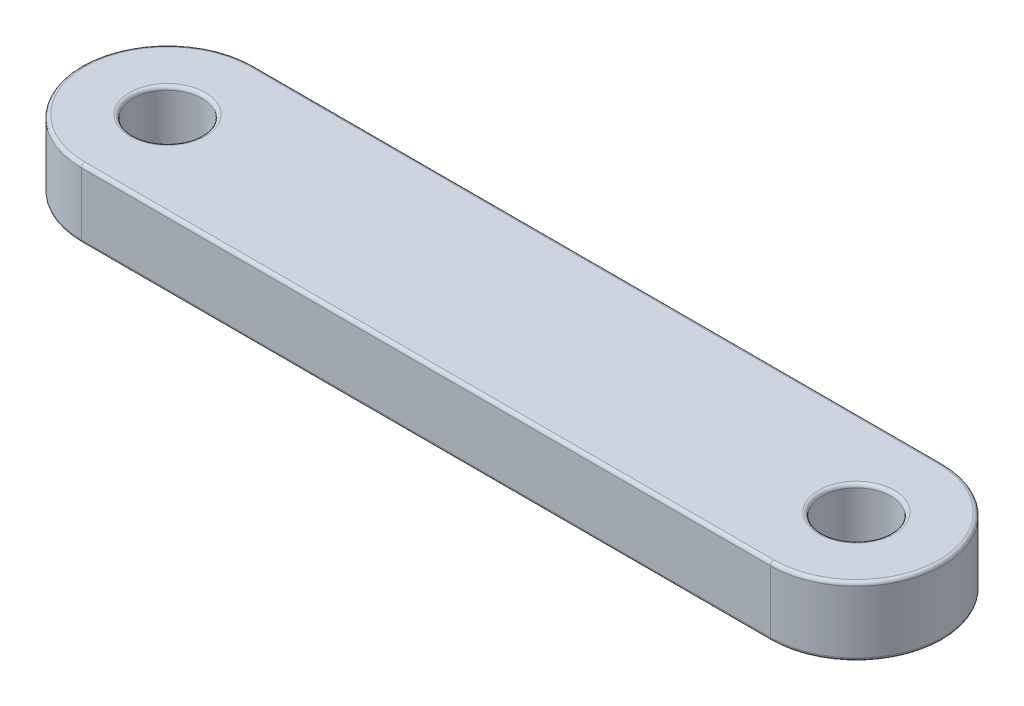
ISO-10303-21;
HEADER;
FILE_DESCRIPTION(('STEP AP214'),'2;1');
FILE_NAME('part.step','',(''),(''),'','','');
FILE_SCHEMA(('AUTOMOTIVE_DESIGN { 1 0 10303 214 1 1 1 1 }'));
ENDSEC;
DATA;
#1=APPLICATION_CONTEXT('core data for automotive mechanical design processes');
#2=APPLICATION_PROTOCOL_DEFINITION('international standard','automotive_design',2000,#1);
#3=PRODUCT_CONTEXT('',#1,'mechanical');
#4=PRODUCT('Part','Part','',(#3));
#5=PRODUCT_RELATED_PRODUCT_CATEGORY('part','',(#4));
#6=PRODUCT_DEFINITION_FORMATION('','',#4);
#7=PRODUCT_DEFINITION_CONTEXT('part definition',#1,'design');
#8=PRODUCT_DEFINITION('design','',#6,#7);
#9=PRODUCT_DEFINITION_SHAPE('','',#8);
#10=(LENGTH_UNIT() NAMED_UNIT(*) SI_UNIT(.MILLI.,.METRE.));
#11=(NAMED_UNIT(*) PLANE_ANGLE_UNIT() SI_UNIT($,.RADIAN.));
#12=(NAMED_UNIT(*) SI_UNIT($,.STERADIAN.) SOLID_ANGLE_UNIT());
#13=UNCERTAINTY_MEASURE_WITH_UNIT(LENGTH_MEASURE(1.E-05),#10,'distance_accuracy_value','');
#14=(GEOMETRIC_REPRESENTATION_CONTEXT(3) GLOBAL_UNCERTAINTY_ASSIGNED_CONTEXT((#13)) GLOBAL_UNIT_ASSIGNED_CONTEXT((#10,
#11,#12)) REPRESENTATION_CONTEXT('',''));
#15=CARTESIAN_POINT('',(0.,0.,0.));
#16=DIRECTION('',(0.,0.,1.));
#17=DIRECTION('',(1.,0.,0.));
#18=AXIS2_PLACEMENT_3D('',#15,#16,#17);
#19=CARTESIAN_POINT('',(-100.,20.,0.));
#20=DIRECTION('',(0.,1.,0.));
#21=DIRECTION('',(0.,0.,1.));
#22=AXIS2_PLACEMENT_3D('',#19,#20,#21);
#23=PLANE('',#22);
#24=CARTESIAN_POINT('',(100.,20.,0.));
#25=DIRECTION('',(0.,1.,0.));
#26=DIRECTION('',(0.,0.,1.));
#27=AXIS2_PLACEMENT_3D('',#24,#25,#26);
#28=CIRCLE('',#27,11.);
#29=CARTESIAN_POINT('',(100.,20.,11.));
#30=VERTEX_POINT('',#29);
#31=EDGE_CURVE('E11',#30,#30,#28,.F.);
#32=ORIENTED_EDGE('',*,*,#31,.T.);
#33=EDGE_LOOP('',(#32));
#34=FACE_BOUND('',#33,.T.);
#35=CARTESIAN_POINT('',(100.,20.,0.));
#36=DIRECTION('',(0.,1.,0.));
#37=DIRECTION('',(0.,0.,1.));
#38=AXIS2_PLACEMENT_3D('',#35,#36,#37);
#39=CIRCLE('',#38,24.);
#40=CARTESIAN_POINT('',(100.,20.,24.));
#41=VERTEX_POINT('',#40);
#42=CARTESIAN_POINT('',(100.,20.,-24.));
#43=VERTEX_POINT('',#42);
#44=EDGE_CURVE('E50',#41,#43,#39,.T.);
#45=ORIENTED_EDGE('',*,*,#44,.T.);
#46=DIRECTION('',(-1.,0.,0.));
#47=VECTOR('',#46,1.);
#48=CARTESIAN_POINT('',(-100.,20.,-24.));
#49=LINE('',#48,#47);
#50=CARTESIAN_POINT('',(-100.,20.,-24.));
#51=VERTEX_POINT('',#50);
#52=EDGE_CURVE('E42',#43,#51,#49,.T.);
#53=ORIENTED_EDGE('',*,*,#52,.T.);
#54=CARTESIAN_POINT('',(-100.,20.,0.));
#55=DIRECTION('',(0.,1.,0.));
#56=DIRECTION('',(0.,0.,1.));
#57=AXIS2_PLACEMENT_3D('',#54,#55,#56);
#58=CIRCLE('',#57,24.);
#59=CARTESIAN_POINT('',(-100.,20.,24.));
#60=VERTEX_POINT('',#59);
#61=EDGE_CURVE('E168',#51,#60,#58,.T.);
#62=ORIENTED_EDGE('',*,*,#61,.T.);
#63=DIRECTION('',(1.,0.,0.));
#64=VECTOR('',#63,1.);
#65=CARTESIAN_POINT('',(100.,20.,24.));
#66=LINE('',#65,#64);
#67=EDGE_CURVE('E55',#60,#41,#66,.T.);
#68=ORIENTED_EDGE('',*,*,#67,.T.);
#69=EDGE_LOOP('',(#45,#53,#62,#68));
#70=FACE_BOUND('',#69,.T.);
#71=CARTESIAN_POINT('',(-100.,20.,0.));
#72=DIRECTION('',(0.,1.,0.));
#73=DIRECTION('',(0.,0.,1.));
#74=AXIS2_PLACEMENT_3D('',#71,#72,#73);
#75=CIRCLE('',#74,11.);
#76=CARTESIAN_POINT('',(-100.,20.,11.));
#77=VERTEX_POINT('',#76);
#78=EDGE_CURVE('E165',#77,#77,#75,.F.);
#79=ORIENTED_EDGE('',*,*,#78,.T.);
#80=EDGE_LOOP('',(#79));
#81=FACE_BOUND('',#80,.T.);
#82=ADVANCED_FACE('F33',(#34,#70,#81),#23,.T.);
#83=CARTESIAN_POINT('',(-100.,0.,0.));
#84=DIRECTION('',(0.,1.,0.));
#85=DIRECTION('',(0.,0.,1.));
#86=AXIS2_PLACEMENT_3D('',#83,#84,#85);
#87=PLANE('',#86);
#88=CARTESIAN_POINT('',(100.,0.,0.));
#89=DIRECTION('',(0.,1.,0.));
#90=DIRECTION('',(0.,0.,1.));
#91=AXIS2_PLACEMENT_3D('',#88,#89,#90);
#92=CIRCLE('',#91,11.);
#93=CARTESIAN_POINT('',(100.,0.,11.));
#94=VERTEX_POINT('',#93);
#95=EDGE_CURVE('E130',#94,#94,#92,.T.);
#96=ORIENTED_EDGE('',*,*,#95,.T.);
#97=EDGE_LOOP('',(#96));
#98=FACE_BOUND('',#97,.T.);
#99=CARTESIAN_POINT('',(-100.,0.,0.));
#100=DIRECTION('',(0.,1.,0.));
#101=DIRECTION('',(0.,0.,1.));
#102=AXIS2_PLACEMENT_3D('',#99,#100,#101);
#103=CIRCLE('',#102,11.);
#104=CARTESIAN_POINT('',(-100.,0.,11.));
#105=VERTEX_POINT('',#104);
#106=EDGE_CURVE('E127',#105,#105,#103,.T.);
#107=ORIENTED_EDGE('',*,*,#106,.T.);
#108=EDGE_LOOP('',(#107));
#109=FACE_BOUND('',#108,.T.);
#110=CARTESIAN_POINT('',(100.,0.,0.));
#111=DIRECTION('',(0.,1.,0.));
#112=DIRECTION('',(0.,0.,1.));
#113=AXIS2_PLACEMENT_3D('',#110,#111,#112);
#114=CIRCLE('',#113,24.);
#115=CARTESIAN_POINT('',(100.,0.,-24.));
#116=VERTEX_POINT('',#115);
#117=CARTESIAN_POINT('',(100.,0.,24.));
#118=VERTEX_POINT('',#117);
#119=EDGE_CURVE('E126',#116,#118,#114,.F.);
#120=ORIENTED_EDGE('',*,*,#119,.T.);
#121=DIRECTION('',(1.,0.,0.));
#122=VECTOR('',#121,1.);
#123=CARTESIAN_POINT('',(-100.,0.,24.));
#124=LINE('',#123,#122);
#125=CARTESIAN_POINT('',(-100.,0.,24.));
#126=VERTEX_POINT('',#125);
#127=EDGE_CURVE('E105',#118,#126,#124,.F.);
#128=ORIENTED_EDGE('',*,*,#127,.T.);
#129=CARTESIAN_POINT('',(-100.,0.,0.));
#130=DIRECTION('',(0.,1.,0.));
#131=DIRECTION('',(0.,0.,1.));
#132=AXIS2_PLACEMENT_3D('',#129,#130,#131);
#133=CIRCLE('',#132,24.);
#134=CARTESIAN_POINT('',(-100.,0.,-24.));
#135=VERTEX_POINT('',#134);
#136=EDGE_CURVE('E115',#126,#135,#133,.F.);
#137=ORIENTED_EDGE('',*,*,#136,.T.);
#138=DIRECTION('',(-1.,0.,0.));
#139=VECTOR('',#138,1.);
#140=CARTESIAN_POINT('',(-100.,0.,-24.));
#141=LINE('',#140,#139);
#142=EDGE_CURVE('E121',#135,#116,#141,.F.);
#143=ORIENTED_EDGE('',*,*,#142,.T.);
#144=EDGE_LOOP('',(#120,#128,#137,#143));
#145=FACE_BOUND('',#144,.T.);
#146=ADVANCED_FACE('F124',(#98,#109,#145),#87,.F.);
#147=CARTESIAN_POINT('',(-100.,20.,0.));
#148=DIRECTION('',(0.,-1.,0.));
#149=DIRECTION('',(0.,0.,-1.));
#150=AXIS2_PLACEMENT_3D('',#147,#148,#149);
#151=CYLINDRICAL_SURFACE('',#150,25.);
#152=DIRECTION('',(0.,-1.,0.));
#153=VECTOR('',#152,1.);
#154=CARTESIAN_POINT('',(-100.,20.,-25.));
#155=LINE('',#154,#153);
#156=CARTESIAN_POINT('',(-100.,19.,-25.));
#157=VERTEX_POINT('',#156);
#158=CARTESIAN_POINT('',(-100.,1.,-25.));
#159=VERTEX_POINT('',#158);
#160=EDGE_CURVE('E177',#157,#159,#155,.T.);
#161=ORIENTED_EDGE('',*,*,#160,.T.);
#162=CARTESIAN_POINT('',(-100.,1.,0.));
#163=DIRECTION('',(0.,1.,0.));
#164=DIRECTION('',(0.,0.,1.));
#165=AXIS2_PLACEMENT_3D('',#162,#163,#164);
#166=CIRCLE('',#165,25.);
#167=CARTESIAN_POINT('',(-100.,1.,25.));
#168=VERTEX_POINT('',#167);
#169=EDGE_CURVE('E163',#159,#168,#166,.T.);
#170=ORIENTED_EDGE('',*,*,#169,.T.);
#171=DIRECTION('',(0.,-1.,0.));
#172=VECTOR('',#171,1.);
#173=CARTESIAN_POINT('',(-100.,20.,25.));
#174=LINE('',#173,#172);
#175=CARTESIAN_POINT('',(-100.,19.,25.));
#176=VERTEX_POINT('',#175);
#177=EDGE_CURVE('E122',#176,#168,#174,.T.);
#178=ORIENTED_EDGE('',*,*,#177,.F.);
#179=CARTESIAN_POINT('',(-100.,19.,0.));
#180=DIRECTION('',(0.,1.,0.));
#181=DIRECTION('',(0.,0.,1.));
#182=AXIS2_PLACEMENT_3D('',#179,#180,#181);
#183=CIRCLE('',#182,25.);
#184=EDGE_CURVE('E161',#176,#157,#183,.F.);
#185=ORIENTED_EDGE('',*,*,#184,.T.);
#186=EDGE_LOOP('',(#161,#170,#178,#185));
#187=FACE_BOUND('',#186,.T.);
#188=ADVANCED_FACE('F203',(#187),#151,.T.);
#189=CARTESIAN_POINT('',(-100.,20.,25.));
#190=DIRECTION('',(0.,0.,-1.));
#191=DIRECTION('',(-1.,0.,0.));
#192=AXIS2_PLACEMENT_3D('',#189,#190,#191);
#193=PLANE('',#192);
#194=ORIENTED_EDGE('',*,*,#177,.T.);
#195=DIRECTION('',(1.,0.,0.));
#196=VECTOR('',#195,1.);
#197=CARTESIAN_POINT('',(-100.,1.,25.));
#198=LINE('',#197,#196);
#199=CARTESIAN_POINT('',(100.,1.,25.));
#200=VERTEX_POINT('',#199);
#201=EDGE_CURVE('E108',#168,#200,#198,.T.);
#202=ORIENTED_EDGE('',*,*,#201,.T.);
#203=DIRECTION('',(0.,-1.,0.));
#204=VECTOR('',#203,1.);
#205=CARTESIAN_POINT('',(100.,20.,25.));
#206=LINE('',#205,#204);
#207=CARTESIAN_POINT('',(100.,19.,25.));
#208=VERTEX_POINT('',#207);
#209=EDGE_CURVE('E200',#208,#200,#206,.T.);
#210=ORIENTED_EDGE('',*,*,#209,.F.);
#211=DIRECTION('',(1.,0.,0.));
#212=VECTOR('',#211,1.);
#213=CARTESIAN_POINT('',(-100.,19.,25.));
#214=LINE('',#213,#212);
#215=EDGE_CURVE('E149',#208,#176,#214,.F.);
#216=ORIENTED_EDGE('',*,*,#215,.T.);
#217=EDGE_LOOP('',(#194,#202,#210,#216));
#218=FACE_BOUND('',#217,.T.);
#219=ADVANCED_FACE('F198',(#218),#193,.F.);
#220=CARTESIAN_POINT('',(100.,20.,0.));
#221=DIRECTION('',(0.,-1.,0.));
#222=DIRECTION('',(0.,0.,-1.));
#223=AXIS2_PLACEMENT_3D('',#220,#221,#222);
#224=CYLINDRICAL_SURFACE('',#223,25.);
#225=ORIENTED_EDGE('',*,*,#209,.T.);
#226=CARTESIAN_POINT('',(100.,1.,0.));
#227=DIRECTION('',(0.,1.,0.));
#228=DIRECTION('',(0.,0.,1.));
#229=AXIS2_PLACEMENT_3D('',#226,#227,#228);
#230=CIRCLE('',#229,25.);
#231=CARTESIAN_POINT('',(100.,1.,-25.));
#232=VERTEX_POINT('',#231);
#233=EDGE_CURVE('E154',#200,#232,#230,.T.);
#234=ORIENTED_EDGE('',*,*,#233,.T.);
#235=DIRECTION('',(0.,-1.,0.));
#236=VECTOR('',#235,1.);
#237=CARTESIAN_POINT('',(100.,20.,-25.));
#238=LINE('',#237,#236);
#239=CARTESIAN_POINT('',(100.,19.,-25.));
#240=VERTEX_POINT('',#239);
#241=EDGE_CURVE('E206',#240,#232,#238,.T.);
#242=ORIENTED_EDGE('',*,*,#241,.F.);
#243=CARTESIAN_POINT('',(100.,19.,0.));
#244=DIRECTION('',(0.,1.,0.));
#245=DIRECTION('',(0.,0.,1.));
#246=AXIS2_PLACEMENT_3D('',#243,#244,#245);
#247=CIRCLE('',#246,25.);
#248=EDGE_CURVE('E152',#240,#208,#247,.F.);
#249=ORIENTED_EDGE('',*,*,#248,.T.);
#250=EDGE_LOOP('',(#225,#234,#242,#249));
#251=FACE_BOUND('',#250,.T.);
#252=ADVANCED_FACE('F219',(#251),#224,.T.);
#253=CARTESIAN_POINT('',(-100.,20.,-25.));
#254=DIRECTION('',(0.,0.,1.));
#255=DIRECTION('',(1.,0.,0.));
#256=AXIS2_PLACEMENT_3D('',#253,#254,#255);
#257=PLANE('',#256);
#258=ORIENTED_EDGE('',*,*,#241,.T.);
#259=DIRECTION('',(-1.,0.,0.));
#260=VECTOR('',#259,1.);
#261=CARTESIAN_POINT('',(-100.,1.,-25.));
#262=LINE('',#261,#260);
#263=EDGE_CURVE('E159',#232,#159,#262,.T.);
#264=ORIENTED_EDGE('',*,*,#263,.T.);
#265=ORIENTED_EDGE('',*,*,#160,.F.);
#266=DIRECTION('',(-1.,0.,0.));
#267=VECTOR('',#266,1.);
#268=CARTESIAN_POINT('',(100.,19.,-25.));
#269=LINE('',#268,#267);
#270=EDGE_CURVE('E156',#157,#240,#269,.F.);
#271=ORIENTED_EDGE('',*,*,#270,.T.);
#272=EDGE_LOOP('',(#258,#264,#265,#271));
#273=FACE_BOUND('',#272,.T.);
#274=ADVANCED_FACE('F223',(#273),#257,.F.);
#275=CARTESIAN_POINT('',(-100.,20.,0.));
#276=DIRECTION('',(0.,-1.,0.));
#277=DIRECTION('',(0.,0.,-1.));
#278=AXIS2_PLACEMENT_3D('',#275,#276,#277);
#279=CYLINDRICAL_SURFACE('',#278,9.99999999999999);
#280=CARTESIAN_POINT('',(-100.,1.,0.));
#281=DIRECTION('',(0.,1.,0.));
#282=DIRECTION('',(0.,0.,1.));
#283=AXIS2_PLACEMENT_3D('',#280,#281,#282);
#284=CIRCLE('',#283,9.99999999999999);
#285=CARTESIAN_POINT('',(-100.,1.,9.99999999999999));
#286=VERTEX_POINT('',#285);
#287=EDGE_CURVE('E146',#286,#286,#284,.F.);
#288=ORIENTED_EDGE('',*,*,#287,.T.);
#289=EDGE_LOOP('',(#288));
#290=FACE_BOUND('',#289,.T.);
#291=CARTESIAN_POINT('',(-100.,19.,0.));
#292=DIRECTION('',(0.,1.,0.));
#293=DIRECTION('',(0.,0.,1.));
#294=AXIS2_PLACEMENT_3D('',#291,#292,#293);
#295=CIRCLE('',#294,9.99999999999999);
#296=CARTESIAN_POINT('',(-100.,19.,9.99999999999999));
#297=VERTEX_POINT('',#296);
#298=EDGE_CURVE('E143',#297,#297,#295,.T.);
#299=ORIENTED_EDGE('',*,*,#298,.T.);
#300=EDGE_LOOP('',(#299));
#301=FACE_BOUND('',#300,.T.);
#302=ADVANCED_FACE('F239',(#290,#301),#279,.F.);
#303=CARTESIAN_POINT('',(100.,20.,0.));
#304=DIRECTION('',(0.,-1.,0.));
#305=DIRECTION('',(0.,0.,-1.));
#306=AXIS2_PLACEMENT_3D('',#303,#304,#305);
#307=CYLINDRICAL_SURFACE('',#306,9.99999999999999);
#308=CARTESIAN_POINT('',(100.,1.,0.));
#309=DIRECTION('',(0.,1.,0.));
#310=DIRECTION('',(0.,0.,1.));
#311=AXIS2_PLACEMENT_3D('',#308,#309,#310);
#312=CIRCLE('',#311,9.99999999999999);
#313=CARTESIAN_POINT('',(100.,1.,9.99999999999999));
#314=VERTEX_POINT('',#313);
#315=EDGE_CURVE('E140',#314,#314,#312,.F.);
#316=ORIENTED_EDGE('',*,*,#315,.T.);
#317=EDGE_LOOP('',(#316));
#318=FACE_BOUND('',#317,.T.);
#319=CARTESIAN_POINT('',(100.,19.,0.));
#320=DIRECTION('',(0.,1.,0.));
#321=DIRECTION('',(0.,0.,1.));
#322=AXIS2_PLACEMENT_3D('',#319,#320,#321);
#323=CIRCLE('',#322,9.99999999999999);
#324=CARTESIAN_POINT('',(100.,19.,9.99999999999999));
#325=VERTEX_POINT('',#324);
#326=EDGE_CURVE('E137',#325,#325,#323,.T.);
#327=ORIENTED_EDGE('',*,*,#326,.T.);
#328=EDGE_LOOP('',(#327));
#329=FACE_BOUND('',#328,.T.);
#330=ADVANCED_FACE('F241',(#318,#329),#307,.F.);
#331=CARTESIAN_POINT('',(100.,1.,0.));
#332=DIRECTION('',(0.,1.,0.));
#333=DIRECTION('',(0.,0.,1.));
#334=AXIS2_PLACEMENT_3D('',#331,#332,#333);
#335=TOROIDAL_SURFACE('',#334,11.,1.);
#336=ORIENTED_EDGE('',*,*,#315,.F.);
#337=EDGE_LOOP('',(#336));
#338=FACE_BOUND('',#337,.T.);
#339=ORIENTED_EDGE('',*,*,#95,.F.);
#340=EDGE_LOOP('',(#339));
#341=FACE_BOUND('',#340,.T.);
#342=ADVANCED_FACE('F248',(#338,#341),#335,.T.);
#343=CARTESIAN_POINT('',(-100.,1.,0.));
#344=DIRECTION('',(0.,1.,0.));
#345=DIRECTION('',(0.,0.,1.));
#346=AXIS2_PLACEMENT_3D('',#343,#344,#345);
#347=TOROIDAL_SURFACE('',#346,11.,1.);
#348=ORIENTED_EDGE('',*,*,#287,.F.);
#349=EDGE_LOOP('',(#348));
#350=FACE_BOUND('',#349,.T.);
#351=ORIENTED_EDGE('',*,*,#106,.F.);
#352=EDGE_LOOP('',(#351));
#353=FACE_BOUND('',#352,.T.);
#354=ADVANCED_FACE('F264',(#350,#353),#347,.T.);
#355=CARTESIAN_POINT('',(-100.,1.,-24.));
#356=DIRECTION('',(-1.,0.,0.));
#357=DIRECTION('',(0.,0.,1.));
#358=AXIS2_PLACEMENT_3D('',#355,#356,#357);
#359=CYLINDRICAL_SURFACE('',#358,1.);
#360=CARTESIAN_POINT('',(100.,1.,-24.));
#361=DIRECTION('',(1.,0.,0.));
#362=DIRECTION('',(0.,0.,-1.));
#363=AXIS2_PLACEMENT_3D('',#360,#361,#362);
#364=CIRCLE('',#363,1.);
#365=EDGE_CURVE('E111',#116,#232,#364,.T.);
#366=ORIENTED_EDGE('',*,*,#365,.F.);
#367=ORIENTED_EDGE('',*,*,#142,.F.);
#368=CARTESIAN_POINT('',(-100.,1.,-24.));
#369=DIRECTION('',(-1.,0.,0.));
#370=DIRECTION('',(0.,0.,1.));
#371=AXIS2_PLACEMENT_3D('',#368,#369,#370);
#372=CIRCLE('',#371,1.);
#373=EDGE_CURVE('E118',#159,#135,#372,.T.);
#374=ORIENTED_EDGE('',*,*,#373,.F.);
#375=ORIENTED_EDGE('',*,*,#263,.F.);
#376=EDGE_LOOP('',(#366,#367,#374,#375));
#377=FACE_BOUND('',#376,.T.);
#378=ADVANCED_FACE('F212',(#377),#359,.T.);
#379=CARTESIAN_POINT('',(-100.,1.,0.));
#380=DIRECTION('',(0.,1.,0.));
#381=DIRECTION('',(0.,0.,1.));
#382=AXIS2_PLACEMENT_3D('',#379,#380,#381);
#383=TOROIDAL_SURFACE('',#382,24.,1.);
#384=ORIENTED_EDGE('',*,*,#373,.T.);
#385=ORIENTED_EDGE('',*,*,#136,.F.);
#386=CARTESIAN_POINT('',(-100.,1.,24.));
#387=DIRECTION('',(1.,0.,0.));
#388=DIRECTION('',(0.,0.,-1.));
#389=AXIS2_PLACEMENT_3D('',#386,#387,#388);
#390=CIRCLE('',#389,1.);
#391=EDGE_CURVE('E101',#168,#126,#390,.T.);
#392=ORIENTED_EDGE('',*,*,#391,.F.);
#393=ORIENTED_EDGE('',*,*,#169,.F.);
#394=EDGE_LOOP('',(#384,#385,#392,#393));
#395=FACE_BOUND('',#394,.T.);
#396=ADVANCED_FACE('F116',(#395),#383,.T.);
#397=CARTESIAN_POINT('',(100.,1.,0.));
#398=DIRECTION('',(0.,1.,0.));
#399=DIRECTION('',(0.,0.,1.));
#400=AXIS2_PLACEMENT_3D('',#397,#398,#399);
#401=TOROIDAL_SURFACE('',#400,24.,1.);
#402=ORIENTED_EDGE('',*,*,#365,.T.);
#403=ORIENTED_EDGE('',*,*,#233,.F.);
#404=CARTESIAN_POINT('',(100.,1.,24.));
#405=DIRECTION('',(-1.,0.,0.));
#406=DIRECTION('',(0.,0.,1.));
#407=AXIS2_PLACEMENT_3D('',#404,#405,#406);
#408=CIRCLE('',#407,1.);
#409=EDGE_CURVE('E112',#118,#200,#408,.T.);
#410=ORIENTED_EDGE('',*,*,#409,.F.);
#411=ORIENTED_EDGE('',*,*,#119,.F.);
#412=EDGE_LOOP('',(#402,#403,#410,#411));
#413=FACE_BOUND('',#412,.T.);
#414=ADVANCED_FACE('F215',(#413),#401,.T.);
#415=CARTESIAN_POINT('',(-100.,1.,24.));
#416=DIRECTION('',(1.,0.,0.));
#417=DIRECTION('',(0.,0.,-1.));
#418=AXIS2_PLACEMENT_3D('',#415,#416,#417);
#419=CYLINDRICAL_SURFACE('',#418,1.);
#420=ORIENTED_EDGE('',*,*,#391,.T.);
#421=ORIENTED_EDGE('',*,*,#127,.F.);
#422=ORIENTED_EDGE('',*,*,#409,.T.);
#423=ORIENTED_EDGE('',*,*,#201,.F.);
#424=EDGE_LOOP('',(#420,#421,#422,#423));
#425=FACE_BOUND('',#424,.T.);
#426=ADVANCED_FACE('F103',(#425),#419,.T.);
#427=CARTESIAN_POINT('',(100.,19.,0.));
#428=DIRECTION('',(0.,1.,0.));
#429=DIRECTION('',(0.,0.,1.));
#430=AXIS2_PLACEMENT_3D('',#427,#428,#429);
#431=TOROIDAL_SURFACE('',#430,11.,1.);
#432=ORIENTED_EDGE('',*,*,#31,.F.);
#433=EDGE_LOOP('',(#432));
#434=FACE_BOUND('',#433,.T.);
#435=ORIENTED_EDGE('',*,*,#326,.F.);
#436=EDGE_LOOP('',(#435));
#437=FACE_BOUND('',#436,.T.);
#438=ADVANCED_FACE('F271',(#434,#437),#431,.T.);
#439=CARTESIAN_POINT('',(-100.,19.,24.));
#440=DIRECTION('',(-1.,0.,0.));
#441=DIRECTION('',(0.,0.,1.));
#442=AXIS2_PLACEMENT_3D('',#439,#440,#441);
#443=CYLINDRICAL_SURFACE('',#442,1.);
#444=CARTESIAN_POINT('',(-100.,19.,24.));
#445=DIRECTION('',(-1.,0.,0.));
#446=DIRECTION('',(0.,0.,1.));
#447=AXIS2_PLACEMENT_3D('',#444,#445,#446);
#448=CIRCLE('',#447,1.);
#449=EDGE_CURVE('E181',#176,#60,#448,.T.);
#450=ORIENTED_EDGE('',*,*,#449,.F.);
#451=ORIENTED_EDGE('',*,*,#215,.F.);
#452=CARTESIAN_POINT('',(100.,19.,24.));
#453=DIRECTION('',(1.,0.,0.));
#454=DIRECTION('',(0.,0.,-1.));
#455=AXIS2_PLACEMENT_3D('',#452,#453,#454);
#456=CIRCLE('',#455,1.);
#457=EDGE_CURVE('E37',#41,#208,#456,.T.);
#458=ORIENTED_EDGE('',*,*,#457,.F.);
#459=ORIENTED_EDGE('',*,*,#67,.F.);
#460=EDGE_LOOP('',(#450,#451,#458,#459));
#461=FACE_BOUND('',#460,.T.);
#462=ADVANCED_FACE('F193',(#461),#443,.T.);
#463=CARTESIAN_POINT('',(100.,19.,0.));
#464=DIRECTION('',(0.,1.,0.));
#465=DIRECTION('',(0.,0.,1.));
#466=AXIS2_PLACEMENT_3D('',#463,#464,#465);
#467=TOROIDAL_SURFACE('',#466,24.,1.);
#468=ORIENTED_EDGE('',*,*,#457,.T.);
#469=ORIENTED_EDGE('',*,*,#248,.F.);
#470=CARTESIAN_POINT('',(100.,19.,-24.));
#471=DIRECTION('',(-1.,0.,0.));
#472=DIRECTION('',(0.,0.,1.));
#473=AXIS2_PLACEMENT_3D('',#470,#471,#472);
#474=CIRCLE('',#473,1.);
#475=EDGE_CURVE('E180',#43,#240,#474,.T.);
#476=ORIENTED_EDGE('',*,*,#475,.F.);
#477=ORIENTED_EDGE('',*,*,#44,.F.);
#478=EDGE_LOOP('',(#468,#469,#476,#477));
#479=FACE_BOUND('',#478,.T.);
#480=ADVANCED_FACE('F190',(#479),#467,.T.);
#481=CARTESIAN_POINT('',(-100.,19.,0.));
#482=DIRECTION('',(0.,1.,0.));
#483=DIRECTION('',(0.,0.,1.));
#484=AXIS2_PLACEMENT_3D('',#481,#482,#483);
#485=TOROIDAL_SURFACE('',#484,24.,1.);
#486=ORIENTED_EDGE('',*,*,#449,.T.);
#487=ORIENTED_EDGE('',*,*,#61,.F.);
#488=CARTESIAN_POINT('',(-100.,19.,-24.));
#489=DIRECTION('',(1.,0.,0.));
#490=DIRECTION('',(0.,0.,-1.));
#491=AXIS2_PLACEMENT_3D('',#488,#489,#490);
#492=CIRCLE('',#491,1.);
#493=EDGE_CURVE('E178',#157,#51,#492,.T.);
#494=ORIENTED_EDGE('',*,*,#493,.F.);
#495=ORIENTED_EDGE('',*,*,#184,.F.);
#496=EDGE_LOOP('',(#486,#487,#494,#495));
#497=FACE_BOUND('',#496,.T.);
#498=ADVANCED_FACE('F228',(#497),#485,.T.);
#499=CARTESIAN_POINT('',(-100.,19.,-24.));
#500=DIRECTION('',(1.,0.,0.));
#501=DIRECTION('',(0.,0.,-1.));
#502=AXIS2_PLACEMENT_3D('',#499,#500,#501);
#503=CYLINDRICAL_SURFACE('',#502,1.);
#504=ORIENTED_EDGE('',*,*,#475,.T.);
#505=ORIENTED_EDGE('',*,*,#270,.F.);
#506=ORIENTED_EDGE('',*,*,#493,.T.);
#507=ORIENTED_EDGE('',*,*,#52,.F.);
#508=EDGE_LOOP('',(#504,#505,#506,#507));
#509=FACE_BOUND('',#508,.T.);
#510=ADVANCED_FACE('F226',(#509),#503,.T.);
#511=CARTESIAN_POINT('',(-100.,19.,0.));
#512=DIRECTION('',(0.,1.,0.));
#513=DIRECTION('',(0.,0.,1.));
#514=AXIS2_PLACEMENT_3D('',#511,#512,#513);
#515=TOROIDAL_SURFACE('',#514,11.,1.);
#516=ORIENTED_EDGE('',*,*,#78,.F.);
#517=EDGE_LOOP('',(#516));
#518=FACE_BOUND('',#517,.T.);
#519=ORIENTED_EDGE('',*,*,#298,.F.);
#520=EDGE_LOOP('',(#519));
#521=FACE_BOUND('',#520,.T.);
#522=ADVANCED_FACE('F35',(#518,#521),#515,.T.);
#523=CLOSED_SHELL('',(#82,#146,#188,#219,#252,#274,#302,#330,#342,#354,#378,#396,#414,#426,#438,
#462,#480,#498,#510,#522));
#524=MANIFOLD_SOLID_BREP('B2',#523);
#525=ADVANCED_BREP_SHAPE_REPRESENTATION('',(#18,#524),#14);
#526=SHAPE_DEFINITION_REPRESENTATION(#9,#525);
ENDSEC;
END-ISO-10303-21;
